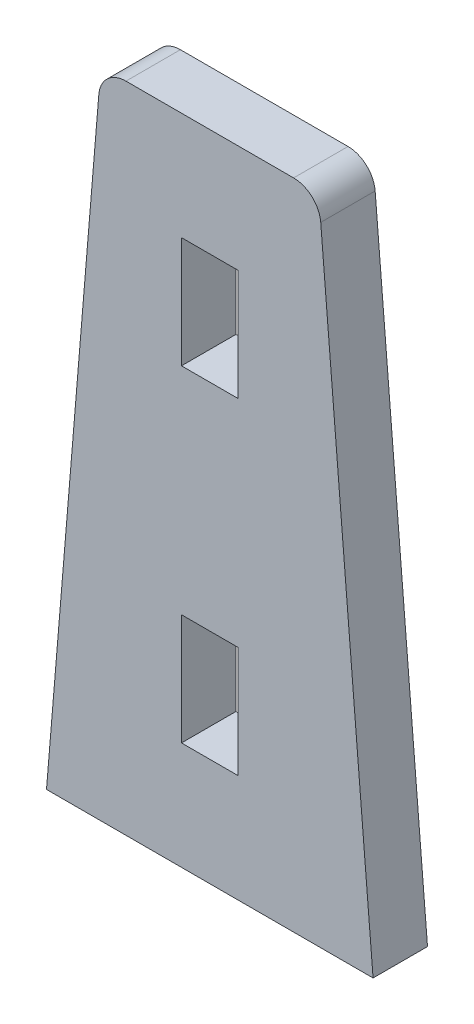
ISO-10303-21;
HEADER;
FILE_DESCRIPTION(('STEP AP214'),'2;1');
FILE_NAME('part.step','',(''),(''),'','','');
FILE_SCHEMA(('AUTOMOTIVE_DESIGN { 1 0 10303 214 1 1 1 1 }'));
ENDSEC;
DATA;
#1=APPLICATION_CONTEXT('core data for automotive mechanical design processes');
#2=APPLICATION_PROTOCOL_DEFINITION('international standard','automotive_design',2000,#1);
#3=PRODUCT_CONTEXT('',#1,'mechanical');
#4=PRODUCT('Part','Part','',(#3));
#5=PRODUCT_RELATED_PRODUCT_CATEGORY('part','',(#4));
#6=PRODUCT_DEFINITION_FORMATION('','',#4);
#7=PRODUCT_DEFINITION_CONTEXT('part definition',#1,'design');
#8=PRODUCT_DEFINITION('design','',#6,#7);
#9=PRODUCT_DEFINITION_SHAPE('','',#8);
#10=(LENGTH_UNIT() NAMED_UNIT(*) SI_UNIT(.MILLI.,.METRE.));
#11=(NAMED_UNIT(*) PLANE_ANGLE_UNIT() SI_UNIT($,.RADIAN.));
#12=(NAMED_UNIT(*) SI_UNIT($,.STERADIAN.) SOLID_ANGLE_UNIT());
#13=UNCERTAINTY_MEASURE_WITH_UNIT(LENGTH_MEASURE(1.E-05),#10,'distance_accuracy_value','');
#14=(GEOMETRIC_REPRESENTATION_CONTEXT(3) GLOBAL_UNCERTAINTY_ASSIGNED_CONTEXT((#13)) GLOBAL_UNIT_ASSIGNED_CONTEXT((#10,
#11,#12)) REPRESENTATION_CONTEXT('',''));
#15=CARTESIAN_POINT('',(0.,0.,0.));
#16=DIRECTION('',(0.,0.,1.));
#17=DIRECTION('',(1.,0.,0.));
#18=AXIS2_PLACEMENT_3D('',#15,#16,#17);
#19=CARTESIAN_POINT('',(-2.4980018054066E-13,2.22044604925031E-13,550.));
#20=DIRECTION('',(0.,0.,-1.));
#21=DIRECTION('',(-1.,0.,0.));
#22=AXIS2_PLACEMENT_3D('',#19,#20,#21);
#23=PLANE('',#22);
#24=DIRECTION('',(1.,0.,0.));
#25=VECTOR('',#24,1.);
#26=CARTESIAN_POINT('',(-225.,150.,550.));
#27=LINE('',#26,#25);
#28=CARTESIAN_POINT('',(-260.39933559217,150.,550.));
#29=VERTEX_POINT('',#28);
#30=CARTESIAN_POINT('',(-229.60066440783,150.,550.));
#31=VERTEX_POINT('',#30);
#32=EDGE_CURVE('E214',#29,#31,#27,.T.);
#33=ORIENTED_EDGE('',*,*,#32,.T.);
#34=CARTESIAN_POINT('',(-229.60066440783,145.,550.));
#35=DIRECTION('',(0.,0.,-1.));
#36=DIRECTION('',(-1.,0.,0.));
#37=AXIS2_PLACEMENT_3D('',#34,#35,#36);
#38=CIRCLE('',#37,5.);
#39=CARTESIAN_POINT('',(-224.617935616606,145.415227399269,550.));
#40=VERTEX_POINT('',#39);
#41=EDGE_CURVE('E44',#31,#40,#38,.T.);
#42=ORIENTED_EDGE('',*,*,#41,.T.);
#43=DIRECTION('',(0.0830454798537398,-0.996545758244879,0.));
#44=VECTOR('',#43,1.);
#45=CARTESIAN_POINT('',(-215.,30.0000000000001,550.000000000001));
#46=LINE('',#45,#44);
#47=CARTESIAN_POINT('',(-215.,30.0000000000001,550.000000000001));
#48=VERTEX_POINT('',#47);
#49=EDGE_CURVE('E217',#40,#48,#46,.T.);
#50=ORIENTED_EDGE('',*,*,#49,.T.);
#51=DIRECTION('',(-1.,0.,0.));
#52=VECTOR('',#51,1.);
#53=CARTESIAN_POINT('',(-215.,30.0000000000001,550.000000000001));
#54=LINE('',#53,#52);
#55=CARTESIAN_POINT('',(-275.,30.0000000000001,550.));
#56=VERTEX_POINT('',#55);
#57=EDGE_CURVE('E219',#48,#56,#54,.T.);
#58=ORIENTED_EDGE('',*,*,#57,.T.);
#59=DIRECTION('',(0.0830454798537402,0.996545758244879,0.));
#60=VECTOR('',#59,1.);
#61=CARTESIAN_POINT('',(-265.,150.,550.));
#62=LINE('',#61,#60);
#63=CARTESIAN_POINT('',(-265.382064383394,145.415227399269,550.));
#64=VERTEX_POINT('',#63);
#65=EDGE_CURVE('E212',#56,#64,#62,.T.);
#66=ORIENTED_EDGE('',*,*,#65,.T.);
#67=CARTESIAN_POINT('',(-260.39933559217,145.,550.));
#68=DIRECTION('',(0.,0.,-1.));
#69=DIRECTION('',(-1.,0.,0.));
#70=AXIS2_PLACEMENT_3D('',#67,#68,#69);
#71=CIRCLE('',#70,5.);
#72=EDGE_CURVE('E244',#64,#29,#71,.T.);
#73=ORIENTED_EDGE('',*,*,#72,.T.);
#74=EDGE_LOOP('',(#33,#42,#50,#58,#66,#73));
#75=FACE_BOUND('',#74,.T.);
#76=DIRECTION('',(0.,1.,0.));
#77=VECTOR('',#76,1.);
#78=CARTESIAN_POINT('',(-250.2,109.8,550.));
#79=LINE('',#78,#77);
#80=CARTESIAN_POINT('',(-250.2,109.8,550.));
#81=VERTEX_POINT('',#80);
#82=CARTESIAN_POINT('',(-250.2,130.2,550.));
#83=VERTEX_POINT('',#82);
#84=EDGE_CURVE('E183',#81,#83,#79,.T.);
#85=ORIENTED_EDGE('',*,*,#84,.F.);
#86=DIRECTION('',(-1.,0.,0.));
#87=VECTOR('',#86,1.);
#88=CARTESIAN_POINT('',(-239.8,109.8,550.));
#89=LINE('',#88,#87);
#90=CARTESIAN_POINT('',(-239.8,109.8,550.));
#91=VERTEX_POINT('',#90);
#92=EDGE_CURVE('E181',#91,#81,#89,.T.);
#93=ORIENTED_EDGE('',*,*,#92,.F.);
#94=DIRECTION('',(0.,-1.,0.));
#95=VECTOR('',#94,1.);
#96=CARTESIAN_POINT('',(-239.8,130.2,550.));
#97=LINE('',#96,#95);
#98=CARTESIAN_POINT('',(-239.8,130.2,550.));
#99=VERTEX_POINT('',#98);
#100=EDGE_CURVE('E189',#99,#91,#97,.T.);
#101=ORIENTED_EDGE('',*,*,#100,.F.);
#102=DIRECTION('',(1.,0.,0.));
#103=VECTOR('',#102,1.);
#104=CARTESIAN_POINT('',(-250.2,130.2,550.));
#105=LINE('',#104,#103);
#106=EDGE_CURVE('E186',#83,#99,#105,.T.);
#107=ORIENTED_EDGE('',*,*,#106,.F.);
#108=EDGE_LOOP('',(#85,#93,#101,#107));
#109=FACE_BOUND('',#108,.T.);
#110=DIRECTION('',(0.,1.,0.));
#111=VECTOR('',#110,1.);
#112=CARTESIAN_POINT('',(-250.2,49.8000000000002,550.));
#113=LINE('',#112,#111);
#114=CARTESIAN_POINT('',(-250.2,49.8000000000002,550.));
#115=VERTEX_POINT('',#114);
#116=CARTESIAN_POINT('',(-250.2,70.2000000000003,550.));
#117=VERTEX_POINT('',#116);
#118=EDGE_CURVE('E150',#115,#117,#113,.T.);
#119=ORIENTED_EDGE('',*,*,#118,.F.);
#120=DIRECTION('',(-1.,0.,0.));
#121=VECTOR('',#120,1.);
#122=CARTESIAN_POINT('',(-239.8,49.8000000000002,550.));
#123=LINE('',#122,#121);
#124=CARTESIAN_POINT('',(-239.8,49.8000000000002,550.));
#125=VERTEX_POINT('',#124);
#126=EDGE_CURVE('E140',#125,#115,#123,.T.);
#127=ORIENTED_EDGE('',*,*,#126,.F.);
#128=DIRECTION('',(0.,-1.,0.));
#129=VECTOR('',#128,1.);
#130=CARTESIAN_POINT('',(-239.8,70.2000000000001,550.));
#131=LINE('',#130,#129);
#132=CARTESIAN_POINT('',(-239.8,70.1999999999998,550.));
#133=VERTEX_POINT('',#132);
#134=EDGE_CURVE('E165',#133,#125,#131,.T.);
#135=ORIENTED_EDGE('',*,*,#134,.F.);
#136=DIRECTION('',(1.,0.,0.));
#137=VECTOR('',#136,1.);
#138=CARTESIAN_POINT('',(-250.2,70.2000000000003,550.));
#139=LINE('',#138,#137);
#140=EDGE_CURVE('E163',#117,#133,#139,.T.);
#141=ORIENTED_EDGE('',*,*,#140,.F.);
#142=EDGE_LOOP('',(#119,#127,#135,#141));
#143=FACE_BOUND('',#142,.T.);
#144=ADVANCED_FACE('F36',(#75,#109,#143),#23,.T.);
#145=CARTESIAN_POINT('',(-2.4980018054066E-13,1.11022302462516E-13,560.));
#146=DIRECTION('',(0.,0.,-1.));
#147=DIRECTION('',(-1.,0.,0.));
#148=AXIS2_PLACEMENT_3D('',#145,#146,#147);
#149=PLANE('',#148);
#150=DIRECTION('',(-1.,0.,0.));
#151=VECTOR('',#150,1.);
#152=CARTESIAN_POINT('',(-239.8,109.800000000001,560.));
#153=LINE('',#152,#151);
#154=CARTESIAN_POINT('',(-239.8,109.8,560.));
#155=VERTEX_POINT('',#154);
#156=CARTESIAN_POINT('',(-250.2,109.8,560.));
#157=VERTEX_POINT('',#156);
#158=EDGE_CURVE('E158',#155,#157,#153,.T.);
#159=ORIENTED_EDGE('',*,*,#158,.T.);
#160=DIRECTION('',(0.,1.,0.));
#161=VECTOR('',#160,1.);
#162=CARTESIAN_POINT('',(-250.2,109.8,560.));
#163=LINE('',#162,#161);
#164=CARTESIAN_POINT('',(-250.200000000001,130.2,560.));
#165=VERTEX_POINT('',#164);
#166=EDGE_CURVE('E194',#157,#165,#163,.T.);
#167=ORIENTED_EDGE('',*,*,#166,.T.);
#168=DIRECTION('',(1.,0.,0.));
#169=VECTOR('',#168,1.);
#170=CARTESIAN_POINT('',(-250.200000000001,130.2,560.));
#171=LINE('',#170,#169);
#172=CARTESIAN_POINT('',(-239.8,130.2,560.));
#173=VERTEX_POINT('',#172);
#174=EDGE_CURVE('E197',#165,#173,#171,.T.);
#175=ORIENTED_EDGE('',*,*,#174,.T.);
#176=DIRECTION('',(0.,-1.,0.));
#177=VECTOR('',#176,1.);
#178=CARTESIAN_POINT('',(-239.8,130.2,560.));
#179=LINE('',#178,#177);
#180=EDGE_CURVE('E184',#173,#155,#179,.T.);
#181=ORIENTED_EDGE('',*,*,#180,.T.);
#182=EDGE_LOOP('',(#159,#167,#175,#181));
#183=FACE_BOUND('',#182,.T.);
#184=DIRECTION('',(0.0830454798537398,-0.996545758244879,0.));
#185=VECTOR('',#184,1.);
#186=CARTESIAN_POINT('',(-215.000000000001,30.0000000000001,560.));
#187=LINE('',#186,#185);
#188=CARTESIAN_POINT('',(-224.617935616606,145.415227399269,560.000000000001));
#189=VERTEX_POINT('',#188);
#190=CARTESIAN_POINT('',(-215.000000000001,30.0000000000001,560.));
#191=VERTEX_POINT('',#190);
#192=EDGE_CURVE('E225',#189,#191,#187,.T.);
#193=ORIENTED_EDGE('',*,*,#192,.F.);
#194=CARTESIAN_POINT('',(-229.60066440783,145.,560.));
#195=DIRECTION('',(0.,0.,-1.));
#196=DIRECTION('',(-1.,0.,0.));
#197=AXIS2_PLACEMENT_3D('',#194,#195,#196);
#198=CIRCLE('',#197,5.);
#199=CARTESIAN_POINT('',(-229.60066440783,150.,560.000000000001));
#200=VERTEX_POINT('',#199);
#201=EDGE_CURVE('E238',#189,#200,#198,.F.);
#202=ORIENTED_EDGE('',*,*,#201,.T.);
#203=DIRECTION('',(1.,0.,0.));
#204=VECTOR('',#203,1.);
#205=CARTESIAN_POINT('',(-225.,150.,560.));
#206=LINE('',#205,#204);
#207=CARTESIAN_POINT('',(-260.39933559217,150.,560.));
#208=VERTEX_POINT('',#207);
#209=EDGE_CURVE('E223',#208,#200,#206,.T.);
#210=ORIENTED_EDGE('',*,*,#209,.F.);
#211=CARTESIAN_POINT('',(-260.399335592171,145.,560.000000000001));
#212=DIRECTION('',(0.,0.,-1.));
#213=DIRECTION('',(-1.,0.,0.));
#214=AXIS2_PLACEMENT_3D('',#211,#212,#213);
#215=CIRCLE('',#214,5.);
#216=CARTESIAN_POINT('',(-265.382064383395,145.415227399269,560.));
#217=VERTEX_POINT('',#216);
#218=EDGE_CURVE('E236',#208,#217,#215,.F.);
#219=ORIENTED_EDGE('',*,*,#218,.T.);
#220=DIRECTION('',(0.0830454798537402,0.996545758244879,0.));
#221=VECTOR('',#220,1.);
#222=CARTESIAN_POINT('',(-265.,150.,560.));
#223=LINE('',#222,#221);
#224=CARTESIAN_POINT('',(-275.,30.0000000000001,560.));
#225=VERTEX_POINT('',#224);
#226=EDGE_CURVE('E211',#225,#217,#223,.T.);
#227=ORIENTED_EDGE('',*,*,#226,.F.);
#228=DIRECTION('',(-1.,0.,0.));
#229=VECTOR('',#228,1.);
#230=CARTESIAN_POINT('',(-215.000000000001,30.0000000000001,560.));
#231=LINE('',#230,#229);
#232=EDGE_CURVE('E215',#191,#225,#231,.T.);
#233=ORIENTED_EDGE('',*,*,#232,.F.);
#234=EDGE_LOOP('',(#193,#202,#210,#219,#227,#233));
#235=FACE_BOUND('',#234,.T.);
#236=DIRECTION('',(-1.,0.,0.));
#237=VECTOR('',#236,1.);
#238=CARTESIAN_POINT('',(-239.8,49.8000000000004,560.));
#239=LINE('',#238,#237);
#240=CARTESIAN_POINT('',(-239.8,49.8000000000002,560.));
#241=VERTEX_POINT('',#240);
#242=CARTESIAN_POINT('',(-250.2,49.8000000000003,560.000000000001));
#243=VERTEX_POINT('',#242);
#244=EDGE_CURVE('E169',#241,#243,#239,.T.);
#245=ORIENTED_EDGE('',*,*,#244,.T.);
#246=DIRECTION('',(0.,1.,0.));
#247=VECTOR('',#246,1.);
#248=CARTESIAN_POINT('',(-250.2,49.8000000000003,560.000000000001));
#249=LINE('',#248,#247);
#250=CARTESIAN_POINT('',(-250.2,70.2000000000001,560.));
#251=VERTEX_POINT('',#250);
#252=EDGE_CURVE('E157',#243,#251,#249,.T.);
#253=ORIENTED_EDGE('',*,*,#252,.T.);
#254=DIRECTION('',(1.,0.,0.));
#255=VECTOR('',#254,1.);
#256=CARTESIAN_POINT('',(-250.2,70.2000000000001,560.));
#257=LINE('',#256,#255);
#258=CARTESIAN_POINT('',(-239.8,70.2000000000004,560.));
#259=VERTEX_POINT('',#258);
#260=EDGE_CURVE('E172',#251,#259,#257,.T.);
#261=ORIENTED_EDGE('',*,*,#260,.T.);
#262=DIRECTION('',(0.,-1.,0.));
#263=VECTOR('',#262,1.);
#264=CARTESIAN_POINT('',(-239.8,70.2000000000004,560.));
#265=LINE('',#264,#263);
#266=EDGE_CURVE('E151',#259,#241,#265,.T.);
#267=ORIENTED_EDGE('',*,*,#266,.T.);
#268=EDGE_LOOP('',(#245,#253,#261,#267));
#269=FACE_BOUND('',#268,.T.);
#270=ADVANCED_FACE('F259',(#183,#235,#269),#149,.F.);
#271=CARTESIAN_POINT('',(-265.,150.,550.));
#272=DIRECTION('',(0.99654575824488,-0.0830454798537399,0.));
#273=DIRECTION('',(0.0830454798537402,0.996545758244879,0.));
#274=AXIS2_PLACEMENT_3D('',#271,#272,#273);
#275=PLANE('',#274);
#276=ORIENTED_EDGE('',*,*,#226,.T.);
#277=DIRECTION('',(0.,0.,1.));
#278=VECTOR('',#277,1.);
#279=CARTESIAN_POINT('',(-265.382064383394,145.415227399269,550.));
#280=LINE('',#279,#278);
#281=EDGE_CURVE('E11',#217,#64,#280,.F.);
#282=ORIENTED_EDGE('',*,*,#281,.T.);
#283=ORIENTED_EDGE('',*,*,#65,.F.);
#284=DIRECTION('',(0.,0.,1.));
#285=VECTOR('',#284,1.);
#286=CARTESIAN_POINT('',(-275.,30.0000000000001,550.));
#287=LINE('',#286,#285);
#288=EDGE_CURVE('E221',#56,#225,#287,.T.);
#289=ORIENTED_EDGE('',*,*,#288,.T.);
#290=EDGE_LOOP('',(#276,#282,#283,#289));
#291=FACE_BOUND('',#290,.T.);
#292=ADVANCED_FACE('F267',(#291),#275,.F.);
#293=CARTESIAN_POINT('',(-225.,150.,550.));
#294=DIRECTION('',(0.,-1.,0.));
#295=DIRECTION('',(0.,0.,-1.));
#296=AXIS2_PLACEMENT_3D('',#293,#294,#295);
#297=PLANE('',#296);
#298=ORIENTED_EDGE('',*,*,#209,.T.);
#299=DIRECTION('',(0.,0.,1.));
#300=VECTOR('',#299,1.);
#301=CARTESIAN_POINT('',(-229.60066440783,150.,550.));
#302=LINE('',#301,#300);
#303=EDGE_CURVE('E57',#200,#31,#302,.F.);
#304=ORIENTED_EDGE('',*,*,#303,.T.);
#305=ORIENTED_EDGE('',*,*,#32,.F.);
#306=DIRECTION('',(0.,0.,1.));
#307=VECTOR('',#306,1.);
#308=CARTESIAN_POINT('',(-260.39933559217,150.,550.));
#309=LINE('',#308,#307);
#310=EDGE_CURVE('E240',#29,#208,#309,.T.);
#311=ORIENTED_EDGE('',*,*,#310,.T.);
#312=EDGE_LOOP('',(#298,#304,#305,#311));
#313=FACE_BOUND('',#312,.T.);
#314=ADVANCED_FACE('F262',(#313),#297,.F.);
#315=CARTESIAN_POINT('',(-215.,30.0000000000001,550.000000000001));
#316=DIRECTION('',(-0.99654575824488,-0.08304547985374,0.));
#317=DIRECTION('',(0.0830454798537398,-0.996545758244879,0.));
#318=AXIS2_PLACEMENT_3D('',#315,#316,#317);
#319=PLANE('',#318);
#320=ORIENTED_EDGE('',*,*,#49,.F.);
#321=DIRECTION('',(0.,0.,1.));
#322=VECTOR('',#321,1.);
#323=CARTESIAN_POINT('',(-224.617935616606,145.415227399269,550.));
#324=LINE('',#323,#322);
#325=EDGE_CURVE('E233',#40,#189,#324,.T.);
#326=ORIENTED_EDGE('',*,*,#325,.T.);
#327=ORIENTED_EDGE('',*,*,#192,.T.);
#328=DIRECTION('',(0.,0.,1.));
#329=VECTOR('',#328,1.);
#330=CARTESIAN_POINT('',(-215.,30.0000000000001,550.000000000001));
#331=LINE('',#330,#329);
#332=EDGE_CURVE('E230',#48,#191,#331,.T.);
#333=ORIENTED_EDGE('',*,*,#332,.F.);
#334=EDGE_LOOP('',(#320,#326,#327,#333));
#335=FACE_BOUND('',#334,.T.);
#336=ADVANCED_FACE('F253',(#335),#319,.F.);
#337=CARTESIAN_POINT('',(-215.,30.0000000000001,550.000000000001));
#338=DIRECTION('',(0.,1.,0.));
#339=DIRECTION('',(0.,0.,1.));
#340=AXIS2_PLACEMENT_3D('',#337,#338,#339);
#341=PLANE('',#340);
#342=ORIENTED_EDGE('',*,*,#232,.T.);
#343=ORIENTED_EDGE('',*,*,#288,.F.);
#344=ORIENTED_EDGE('',*,*,#57,.F.);
#345=ORIENTED_EDGE('',*,*,#332,.T.);
#346=EDGE_LOOP('',(#342,#343,#344,#345));
#347=FACE_BOUND('',#346,.T.);
#348=ADVANCED_FACE('F270',(#347),#341,.F.);
#349=CARTESIAN_POINT('',(-239.8,109.8,550.));
#350=DIRECTION('',(0.,1.,0.));
#351=DIRECTION('',(0.,0.,1.));
#352=AXIS2_PLACEMENT_3D('',#349,#350,#351);
#353=PLANE('',#352);
#354=ORIENTED_EDGE('',*,*,#158,.F.);
#355=DIRECTION('',(0.,0.,1.));
#356=VECTOR('',#355,1.);
#357=CARTESIAN_POINT('',(-239.8,109.8,550.));
#358=LINE('',#357,#356);
#359=EDGE_CURVE('E191',#91,#155,#358,.T.);
#360=ORIENTED_EDGE('',*,*,#359,.F.);
#361=ORIENTED_EDGE('',*,*,#92,.T.);
#362=DIRECTION('',(0.,0.,1.));
#363=VECTOR('',#362,1.);
#364=CARTESIAN_POINT('',(-250.2,109.8,550.));
#365=LINE('',#364,#363);
#366=EDGE_CURVE('E208',#81,#157,#365,.T.);
#367=ORIENTED_EDGE('',*,*,#366,.T.);
#368=EDGE_LOOP('',(#354,#360,#361,#367));
#369=FACE_BOUND('',#368,.T.);
#370=ADVANCED_FACE('F272',(#369),#353,.T.);
#371=CARTESIAN_POINT('',(-250.2,109.8,550.));
#372=DIRECTION('',(1.,0.,0.));
#373=DIRECTION('',(0.,0.,-1.));
#374=AXIS2_PLACEMENT_3D('',#371,#372,#373);
#375=PLANE('',#374);
#376=ORIENTED_EDGE('',*,*,#166,.F.);
#377=ORIENTED_EDGE('',*,*,#366,.F.);
#378=ORIENTED_EDGE('',*,*,#84,.T.);
#379=DIRECTION('',(0.,0.,1.));
#380=VECTOR('',#379,1.);
#381=CARTESIAN_POINT('',(-250.2,130.2,550.));
#382=LINE('',#381,#380);
#383=EDGE_CURVE('E206',#83,#165,#382,.T.);
#384=ORIENTED_EDGE('',*,*,#383,.T.);
#385=EDGE_LOOP('',(#376,#377,#378,#384));
#386=FACE_BOUND('',#385,.T.);
#387=ADVANCED_FACE('F278',(#386),#375,.T.);
#388=CARTESIAN_POINT('',(-250.2,130.2,550.));
#389=DIRECTION('',(0.,-1.,0.));
#390=DIRECTION('',(0.,0.,-1.));
#391=AXIS2_PLACEMENT_3D('',#388,#389,#390);
#392=PLANE('',#391);
#393=ORIENTED_EDGE('',*,*,#174,.F.);
#394=ORIENTED_EDGE('',*,*,#383,.F.);
#395=ORIENTED_EDGE('',*,*,#106,.T.);
#396=DIRECTION('',(0.,0.,1.));
#397=VECTOR('',#396,1.);
#398=CARTESIAN_POINT('',(-239.8,130.2,550.));
#399=LINE('',#398,#397);
#400=EDGE_CURVE('E204',#99,#173,#399,.T.);
#401=ORIENTED_EDGE('',*,*,#400,.T.);
#402=EDGE_LOOP('',(#393,#394,#395,#401));
#403=FACE_BOUND('',#402,.T.);
#404=ADVANCED_FACE('F292',(#403),#392,.T.);
#405=CARTESIAN_POINT('',(-239.8,130.2,550.));
#406=DIRECTION('',(-1.,0.,0.));
#407=DIRECTION('',(0.,0.,1.));
#408=AXIS2_PLACEMENT_3D('',#405,#406,#407);
#409=PLANE('',#408);
#410=ORIENTED_EDGE('',*,*,#180,.F.);
#411=ORIENTED_EDGE('',*,*,#400,.F.);
#412=ORIENTED_EDGE('',*,*,#100,.T.);
#413=ORIENTED_EDGE('',*,*,#359,.T.);
#414=EDGE_LOOP('',(#410,#411,#412,#413));
#415=FACE_BOUND('',#414,.T.);
#416=ADVANCED_FACE('F296',(#415),#409,.T.);
#417=CARTESIAN_POINT('',(-239.8,49.8000000000002,550.));
#418=DIRECTION('',(0.,1.,0.));
#419=DIRECTION('',(0.,0.,1.));
#420=AXIS2_PLACEMENT_3D('',#417,#418,#419);
#421=PLANE('',#420);
#422=ORIENTED_EDGE('',*,*,#244,.F.);
#423=DIRECTION('',(0.,0.,1.));
#424=VECTOR('',#423,1.);
#425=CARTESIAN_POINT('',(-239.8,49.8000000000002,550.));
#426=LINE('',#425,#424);
#427=EDGE_CURVE('E146',#125,#241,#426,.T.);
#428=ORIENTED_EDGE('',*,*,#427,.F.);
#429=ORIENTED_EDGE('',*,*,#126,.T.);
#430=DIRECTION('',(0.,0.,1.));
#431=VECTOR('',#430,1.);
#432=CARTESIAN_POINT('',(-250.2,49.8000000000002,550.));
#433=LINE('',#432,#431);
#434=EDGE_CURVE('E143',#115,#243,#433,.T.);
#435=ORIENTED_EDGE('',*,*,#434,.T.);
#436=EDGE_LOOP('',(#422,#428,#429,#435));
#437=FACE_BOUND('',#436,.T.);
#438=ADVANCED_FACE('F142',(#437),#421,.T.);
#439=CARTESIAN_POINT('',(-250.2,49.8000000000002,550.));
#440=DIRECTION('',(1.,0.,0.));
#441=DIRECTION('',(0.,0.,-1.));
#442=AXIS2_PLACEMENT_3D('',#439,#440,#441);
#443=PLANE('',#442);
#444=ORIENTED_EDGE('',*,*,#252,.F.);
#445=ORIENTED_EDGE('',*,*,#434,.F.);
#446=ORIENTED_EDGE('',*,*,#118,.T.);
#447=DIRECTION('',(0.,0.,1.));
#448=VECTOR('',#447,1.);
#449=CARTESIAN_POINT('',(-250.2,70.2000000000003,550.));
#450=LINE('',#449,#448);
#451=EDGE_CURVE('E159',#117,#251,#450,.T.);
#452=ORIENTED_EDGE('',*,*,#451,.T.);
#453=EDGE_LOOP('',(#444,#445,#446,#452));
#454=FACE_BOUND('',#453,.T.);
#455=ADVANCED_FACE('F154',(#454),#443,.T.);
#456=CARTESIAN_POINT('',(-250.2,70.2000000000003,550.));
#457=DIRECTION('',(0.,-1.,0.));
#458=DIRECTION('',(0.,0.,-1.));
#459=AXIS2_PLACEMENT_3D('',#456,#457,#458);
#460=PLANE('',#459);
#461=ORIENTED_EDGE('',*,*,#260,.F.);
#462=ORIENTED_EDGE('',*,*,#451,.F.);
#463=ORIENTED_EDGE('',*,*,#140,.T.);
#464=DIRECTION('',(0.,0.,1.));
#465=VECTOR('',#464,1.);
#466=CARTESIAN_POINT('',(-239.8,70.2000000000001,550.));
#467=LINE('',#466,#465);
#468=EDGE_CURVE('E178',#133,#259,#467,.T.);
#469=ORIENTED_EDGE('',*,*,#468,.T.);
#470=EDGE_LOOP('',(#461,#462,#463,#469));
#471=FACE_BOUND('',#470,.T.);
#472=ADVANCED_FACE('F305',(#471),#460,.T.);
#473=CARTESIAN_POINT('',(-239.8,70.2000000000001,550.));
#474=DIRECTION('',(-1.,0.,0.));
#475=DIRECTION('',(0.,0.,1.));
#476=AXIS2_PLACEMENT_3D('',#473,#474,#475);
#477=PLANE('',#476);
#478=ORIENTED_EDGE('',*,*,#266,.F.);
#479=ORIENTED_EDGE('',*,*,#468,.F.);
#480=ORIENTED_EDGE('',*,*,#134,.T.);
#481=ORIENTED_EDGE('',*,*,#427,.T.);
#482=EDGE_LOOP('',(#478,#479,#480,#481));
#483=FACE_BOUND('',#482,.T.);
#484=ADVANCED_FACE('F308',(#483),#477,.T.);
#485=CARTESIAN_POINT('',(-229.60066440783,145.,550.));
#486=DIRECTION('',(0.,0.,1.));
#487=DIRECTION('',(1.,0.,0.));
#488=AXIS2_PLACEMENT_3D('',#485,#486,#487);
#489=CYLINDRICAL_SURFACE('',#488,5.);
#490=ORIENTED_EDGE('',*,*,#41,.F.);
#491=ORIENTED_EDGE('',*,*,#303,.F.);
#492=ORIENTED_EDGE('',*,*,#201,.F.);
#493=ORIENTED_EDGE('',*,*,#325,.F.);
#494=EDGE_LOOP('',(#490,#491,#492,#493));
#495=FACE_BOUND('',#494,.T.);
#496=ADVANCED_FACE('F256',(#495),#489,.T.);
#497=CARTESIAN_POINT('',(-260.39933559217,145.,550.));
#498=DIRECTION('',(0.,0.,1.));
#499=DIRECTION('',(1.,0.,0.));
#500=AXIS2_PLACEMENT_3D('',#497,#498,#499);
#501=CYLINDRICAL_SURFACE('',#500,5.);
#502=ORIENTED_EDGE('',*,*,#72,.F.);
#503=ORIENTED_EDGE('',*,*,#281,.F.);
#504=ORIENTED_EDGE('',*,*,#218,.F.);
#505=ORIENTED_EDGE('',*,*,#310,.F.);
#506=EDGE_LOOP('',(#502,#503,#504,#505));
#507=FACE_BOUND('',#506,.T.);
#508=ADVANCED_FACE('F38',(#507),#501,.T.);
#509=CLOSED_SHELL('',(#144,#270,#292,#314,#336,#348,#370,#387,#404,#416,#438,#455,#472,#484,
#496,#508));
#510=MANIFOLD_SOLID_BREP('B2',#509);
#511=ADVANCED_BREP_SHAPE_REPRESENTATION('',(#18,#510),#14);
#512=SHAPE_DEFINITION_REPRESENTATION(#9,#511);
ENDSEC;
END-ISO-10303-21;
